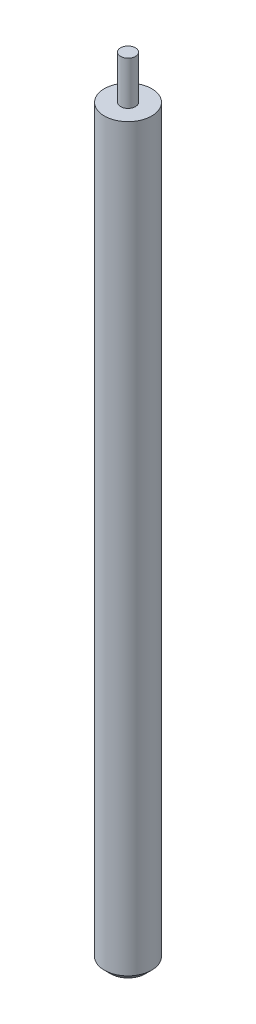
ISO-10303-21;
HEADER;
FILE_DESCRIPTION(('STEP AP214'),'2;1');
FILE_NAME('part.step','',(''),(''),'','','');
FILE_SCHEMA(('AUTOMOTIVE_DESIGN { 1 0 10303 214 1 1 1 1 }'));
ENDSEC;
DATA;
#1=APPLICATION_CONTEXT('core data for automotive mechanical design processes');
#2=APPLICATION_PROTOCOL_DEFINITION('international standard','automotive_design',2000,#1);
#3=PRODUCT_CONTEXT('',#1,'mechanical');
#4=PRODUCT('Part','Part','',(#3));
#5=PRODUCT_RELATED_PRODUCT_CATEGORY('part','',(#4));
#6=PRODUCT_DEFINITION_FORMATION('','',#4);
#7=PRODUCT_DEFINITION_CONTEXT('part definition',#1,'design');
#8=PRODUCT_DEFINITION('design','',#6,#7);
#9=PRODUCT_DEFINITION_SHAPE('','',#8);
#10=(LENGTH_UNIT() NAMED_UNIT(*) SI_UNIT(.MILLI.,.METRE.));
#11=(NAMED_UNIT(*) PLANE_ANGLE_UNIT() SI_UNIT($,.RADIAN.));
#12=(NAMED_UNIT(*) SI_UNIT($,.STERADIAN.) SOLID_ANGLE_UNIT());
#13=UNCERTAINTY_MEASURE_WITH_UNIT(LENGTH_MEASURE(1.E-05),#10,'distance_accuracy_value','');
#14=(GEOMETRIC_REPRESENTATION_CONTEXT(3) GLOBAL_UNCERTAINTY_ASSIGNED_CONTEXT((#13)) GLOBAL_UNIT_ASSIGNED_CONTEXT((#10,
#11,#12)) REPRESENTATION_CONTEXT('',''));
#15=CARTESIAN_POINT('',(0.,0.,0.));
#16=DIRECTION('',(0.,0.,1.));
#17=DIRECTION('',(1.,0.,0.));
#18=AXIS2_PLACEMENT_3D('',#15,#16,#17);
#19=CARTESIAN_POINT('',(0.,635.,0.));
#20=DIRECTION('',(0.,1.,0.));
#21=DIRECTION('',(0.,0.,1.));
#22=AXIS2_PLACEMENT_3D('',#19,#20,#21);
#23=PLANE('',#22);
#24=CARTESIAN_POINT('',(0.,635.,0.));
#25=DIRECTION('',(0.,-1.,0.));
#26=DIRECTION('',(0.,0.,-1.));
#27=AXIS2_PLACEMENT_3D('',#24,#25,#26);
#28=CIRCLE('',#27,5.99999999999998);
#29=CARTESIAN_POINT('',(0.,635.,-5.99999999999998));
#30=VERTEX_POINT('',#29);
#31=EDGE_CURVE('E43',#30,#30,#28,.T.);
#32=ORIENTED_EDGE('',*,*,#31,.F.);
#33=EDGE_LOOP('',(#32));
#34=FACE_BOUND('',#33,.T.);
#35=ADVANCED_FACE('F32',(#34),#23,.T.);
#36=CARTESIAN_POINT('',(0.,0.,0.));
#37=DIRECTION('',(0.,-1.,0.));
#38=DIRECTION('',(0.,0.,-1.));
#39=AXIS2_PLACEMENT_3D('',#36,#37,#38);
#40=CYLINDRICAL_SURFACE('',#39,5.99999999999998);
#41=ORIENTED_EDGE('',*,*,#31,.T.);
#42=EDGE_LOOP('',(#41));
#43=FACE_BOUND('',#42,.T.);
#44=CARTESIAN_POINT('',(0.,600.,0.));
#45=DIRECTION('',(0.,-1.,0.));
#46=DIRECTION('',(0.,0.,-1.));
#47=AXIS2_PLACEMENT_3D('',#44,#45,#46);
#48=CIRCLE('',#47,5.99999999999998);
#49=CARTESIAN_POINT('',(0.,600.,-5.99999999999998));
#50=VERTEX_POINT('',#49);
#51=EDGE_CURVE('E47',#50,#50,#48,.T.);
#52=ORIENTED_EDGE('',*,*,#51,.F.);
#53=EDGE_LOOP('',(#52));
#54=FACE_BOUND('',#53,.T.);
#55=ADVANCED_FACE('F60',(#43,#54),#40,.T.);
#56=CARTESIAN_POINT('',(5.99999999999998,600.,0.));
#57=DIRECTION('',(0.,1.,0.));
#58=DIRECTION('',(0.,0.,1.));
#59=AXIS2_PLACEMENT_3D('',#56,#57,#58);
#60=PLANE('',#59);
#61=ORIENTED_EDGE('',*,*,#51,.T.);
#62=EDGE_LOOP('',(#61));
#63=FACE_BOUND('',#62,.T.);
#64=CARTESIAN_POINT('',(0.,600.,0.));
#65=DIRECTION('',(0.,-1.,0.));
#66=DIRECTION('',(0.,0.,-1.));
#67=AXIS2_PLACEMENT_3D('',#64,#65,#66);
#68=CIRCLE('',#67,19.05);
#69=CARTESIAN_POINT('',(0.,600.,-19.05));
#70=VERTEX_POINT('',#69);
#71=EDGE_CURVE('E52',#70,#70,#68,.T.);
#72=ORIENTED_EDGE('',*,*,#71,.F.);
#73=EDGE_LOOP('',(#72));
#74=FACE_BOUND('',#73,.T.);
#75=ADVANCED_FACE('F58',(#63,#74),#60,.T.);
#76=CARTESIAN_POINT('',(0.,0.,0.));
#77=DIRECTION('',(0.,-1.,0.));
#78=DIRECTION('',(0.,0.,-1.));
#79=AXIS2_PLACEMENT_3D('',#76,#77,#78);
#80=CYLINDRICAL_SURFACE('',#79,19.05);
#81=CARTESIAN_POINT('',(0.,4.99999999999994,0.));
#82=DIRECTION('',(0.,-1.,0.));
#83=DIRECTION('',(0.,0.,-1.));
#84=AXIS2_PLACEMENT_3D('',#81,#82,#83);
#85=CIRCLE('',#84,19.05);
#86=CARTESIAN_POINT('',(0.,4.99999999999994,-19.05));
#87=VERTEX_POINT('',#86);
#88=EDGE_CURVE('E10',#87,#87,#85,.F.);
#89=ORIENTED_EDGE('',*,*,#88,.T.);
#90=EDGE_LOOP('',(#89));
#91=FACE_BOUND('',#90,.T.);
#92=ORIENTED_EDGE('',*,*,#71,.T.);
#93=EDGE_LOOP('',(#92));
#94=FACE_BOUND('',#93,.T.);
#95=ADVANCED_FACE('F56',(#91,#94),#80,.T.);
#96=CARTESIAN_POINT('',(19.05,0.,0.));
#97=DIRECTION('',(0.,-1.,0.));
#98=DIRECTION('',(0.,0.,-1.));
#99=AXIS2_PLACEMENT_3D('',#96,#97,#98);
#100=PLANE('',#99);
#101=CARTESIAN_POINT('',(0.,0.,0.));
#102=DIRECTION('',(0.,-1.,0.));
#103=DIRECTION('',(0.,0.,-1.));
#104=AXIS2_PLACEMENT_3D('',#101,#102,#103);
#105=CIRCLE('',#104,14.0500000000001);
#106=CARTESIAN_POINT('',(0.,0.,-14.0500000000001));
#107=VERTEX_POINT('',#106);
#108=EDGE_CURVE('E39',#107,#107,#105,.T.);
#109=ORIENTED_EDGE('',*,*,#108,.T.);
#110=EDGE_LOOP('',(#109));
#111=FACE_BOUND('',#110,.T.);
#112=ADVANCED_FACE('F67',(#111),#100,.T.);
#113=CARTESIAN_POINT('',(0.,0.,0.));
#114=DIRECTION('',(0.,1.,0.));
#115=DIRECTION('',(0.,0.,1.));
#116=AXIS2_PLACEMENT_3D('',#113,#114,#115);
#117=CONICAL_SURFACE('',#116,14.0500000000001,0.785398163397447);
#118=ORIENTED_EDGE('',*,*,#88,.F.);
#119=EDGE_LOOP('',(#118));
#120=FACE_BOUND('',#119,.T.);
#121=ORIENTED_EDGE('',*,*,#108,.F.);
#122=EDGE_LOOP('',(#121));
#123=FACE_BOUND('',#122,.T.);
#124=ADVANCED_FACE('F34',(#120,#123),#117,.T.);
#125=CLOSED_SHELL('',(#35,#55,#75,#95,#112,#124));
#126=MANIFOLD_SOLID_BREP('B2',#125);
#127=ADVANCED_BREP_SHAPE_REPRESENTATION('',(#18,#126),#14);
#128=SHAPE_DEFINITION_REPRESENTATION(#9,#127);
ENDSEC;
END-ISO-10303-21;
